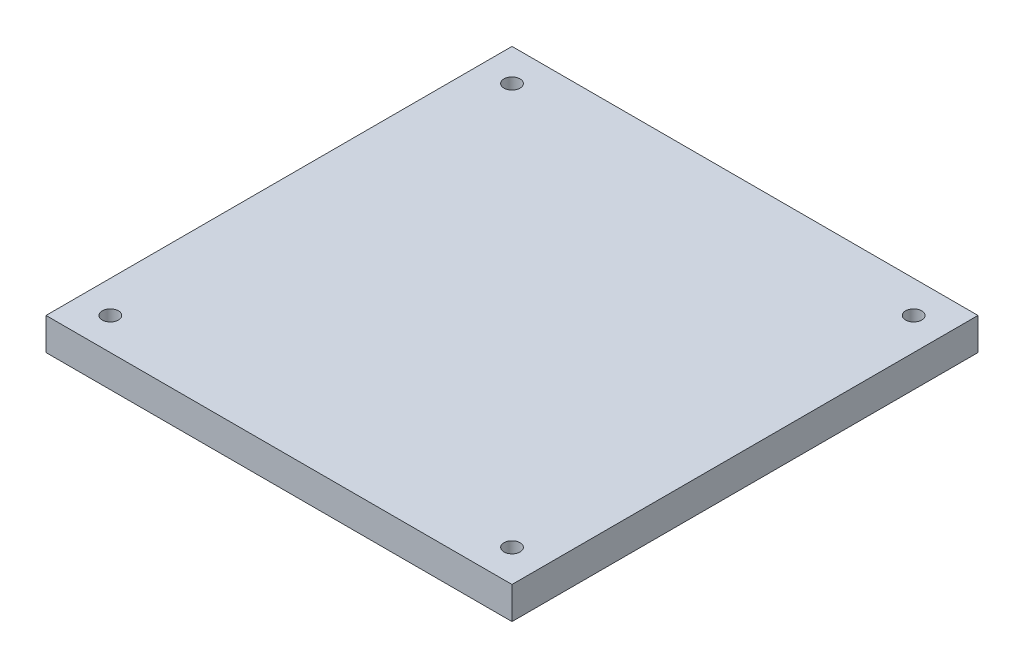
ISO-10303-21;
HEADER;
FILE_DESCRIPTION(('STEP AP214'),'2;1');
FILE_NAME('part.step','',(''),(''),'','','');
FILE_SCHEMA(('AUTOMOTIVE_DESIGN { 1 0 10303 214 1 1 1 1 }'));
ENDSEC;
DATA;
#1=APPLICATION_CONTEXT('core data for automotive mechanical design processes');
#2=APPLICATION_PROTOCOL_DEFINITION('international standard','automotive_design',2000,#1);
#3=PRODUCT_CONTEXT('',#1,'mechanical');
#4=PRODUCT('Part','Part','',(#3));
#5=PRODUCT_RELATED_PRODUCT_CATEGORY('part','',(#4));
#6=PRODUCT_DEFINITION_FORMATION('','',#4);
#7=PRODUCT_DEFINITION_CONTEXT('part definition',#1,'design');
#8=PRODUCT_DEFINITION('design','',#6,#7);
#9=PRODUCT_DEFINITION_SHAPE('','',#8);
#10=(LENGTH_UNIT() NAMED_UNIT(*) SI_UNIT(.MILLI.,.METRE.));
#11=(NAMED_UNIT(*) PLANE_ANGLE_UNIT() SI_UNIT($,.RADIAN.));
#12=(NAMED_UNIT(*) SI_UNIT($,.STERADIAN.) SOLID_ANGLE_UNIT());
#13=UNCERTAINTY_MEASURE_WITH_UNIT(LENGTH_MEASURE(1.E-05),#10,'distance_accuracy_value','');
#14=(GEOMETRIC_REPRESENTATION_CONTEXT(3) GLOBAL_UNCERTAINTY_ASSIGNED_CONTEXT((#13)) GLOBAL_UNIT_ASSIGNED_CONTEXT((#10,
#11,#12)) REPRESENTATION_CONTEXT('',''));
#15=CARTESIAN_POINT('',(0.,0.,0.));
#16=DIRECTION('',(0.,0.,1.));
#17=DIRECTION('',(1.,0.,0.));
#18=AXIS2_PLACEMENT_3D('',#15,#16,#17);
#19=CARTESIAN_POINT('',(0.,6.35,0.));
#20=DIRECTION('',(0.,1.,0.));
#21=DIRECTION('',(0.,0.,1.));
#22=AXIS2_PLACEMENT_3D('',#19,#20,#21);
#23=PLANE('',#22);
#24=CARTESIAN_POINT('',(-30.9701754385965,6.35,51.1342105263158));
#25=DIRECTION('',(0.,1.,0.));
#26=DIRECTION('',(0.,0.,1.));
#27=AXIS2_PLACEMENT_3D('',#24,#25,#26);
#28=CIRCLE('',#27,1.5875);
#29=CARTESIAN_POINT('',(-30.9701754385965,6.35,52.7217105263158));
#30=VERTEX_POINT('',#29);
#31=EDGE_CURVE('E121',#30,#30,#28,.T.);
#32=ORIENTED_EDGE('',*,*,#31,.F.);
#33=EDGE_LOOP('',(#32));
#34=FACE_BOUND('',#33,.T.);
#35=CARTESIAN_POINT('',(-30.9701754385965,6.35,-28.1411112499334));
#36=DIRECTION('',(0.,1.,0.));
#37=DIRECTION('',(0.,0.,1.));
#38=AXIS2_PLACEMENT_3D('',#35,#36,#37);
#39=CIRCLE('',#38,1.5875);
#40=CARTESIAN_POINT('',(-30.9701754385965,6.35,-26.5536112499334));
#41=VERTEX_POINT('',#40);
#42=EDGE_CURVE('E100',#41,#41,#39,.T.);
#43=ORIENTED_EDGE('',*,*,#42,.F.);
#44=EDGE_LOOP('',(#43));
#45=FACE_BOUND('',#44,.T.);
#46=DIRECTION('',(0.,0.,1.));
#47=VECTOR('',#46,1.);
#48=CARTESIAN_POINT('',(-37.3201754385965,6.35,-34.4911112499334));
#49=LINE('',#48,#47);
#50=CARTESIAN_POINT('',(-37.3201754385965,6.35,-34.4911112499334));
#51=VERTEX_POINT('',#50);
#52=CARTESIAN_POINT('',(-37.3201754385965,6.35,57.4842105263158));
#53=VERTEX_POINT('',#52);
#54=EDGE_CURVE('E85',#51,#53,#49,.T.);
#55=ORIENTED_EDGE('',*,*,#54,.T.);
#56=DIRECTION('',(1.,0.,0.));
#57=VECTOR('',#56,1.);
#58=CARTESIAN_POINT('',(-37.3201754385965,6.35,57.4842105263158));
#59=LINE('',#58,#57);
#60=CARTESIAN_POINT('',(54.6551463376527,6.35,57.4842105263158));
#61=VERTEX_POINT('',#60);
#62=EDGE_CURVE('E80',#53,#61,#59,.T.);
#63=ORIENTED_EDGE('',*,*,#62,.T.);
#64=DIRECTION('',(0.,0.,-1.));
#65=VECTOR('',#64,1.);
#66=CARTESIAN_POINT('',(54.6551463376527,6.35,-34.4911112499334));
#67=LINE('',#66,#65);
#68=CARTESIAN_POINT('',(54.6551463376527,6.35,-34.4911112499334));
#69=VERTEX_POINT('',#68);
#70=EDGE_CURVE('E83',#61,#69,#67,.T.);
#71=ORIENTED_EDGE('',*,*,#70,.T.);
#72=DIRECTION('',(-1.,0.,0.));
#73=VECTOR('',#72,1.);
#74=CARTESIAN_POINT('',(-37.3201754385965,6.35,-34.4911112499334));
#75=LINE('',#74,#73);
#76=EDGE_CURVE('E50',#69,#51,#75,.T.);
#77=ORIENTED_EDGE('',*,*,#76,.T.);
#78=EDGE_LOOP('',(#55,#63,#71,#77));
#79=FACE_BOUND('',#78,.T.);
#80=CARTESIAN_POINT('',(48.3051463376527,6.35,-28.1411112499334));
#81=DIRECTION('',(0.,1.,0.));
#82=DIRECTION('',(0.,0.,1.));
#83=AXIS2_PLACEMENT_3D('',#80,#81,#82);
#84=CIRCLE('',#83,1.5875);
#85=CARTESIAN_POINT('',(48.3051463376527,6.35,-26.5536112499334));
#86=VERTEX_POINT('',#85);
#87=EDGE_CURVE('E115',#86,#86,#84,.T.);
#88=ORIENTED_EDGE('',*,*,#87,.F.);
#89=EDGE_LOOP('',(#88));
#90=FACE_BOUND('',#89,.T.);
#91=CARTESIAN_POINT('',(48.3051463376527,6.35,51.1342105263158));
#92=DIRECTION('',(0.,1.,0.));
#93=DIRECTION('',(0.,0.,1.));
#94=AXIS2_PLACEMENT_3D('',#91,#92,#93);
#95=CIRCLE('',#94,1.5875);
#96=CARTESIAN_POINT('',(48.3051463376527,6.35,52.7217105263158));
#97=VERTEX_POINT('',#96);
#98=EDGE_CURVE('E127',#97,#97,#95,.T.);
#99=ORIENTED_EDGE('',*,*,#98,.F.);
#100=EDGE_LOOP('',(#99));
#101=FACE_BOUND('',#100,.T.);
#102=ADVANCED_FACE('F33',(#34,#45,#79,#90,#101),#23,.T.);
#103=CARTESIAN_POINT('',(0.,0.,0.));
#104=DIRECTION('',(0.,1.,0.));
#105=DIRECTION('',(0.,0.,1.));
#106=AXIS2_PLACEMENT_3D('',#103,#104,#105);
#107=PLANE('',#106);
#108=DIRECTION('',(0.,0.,1.));
#109=VECTOR('',#108,1.);
#110=CARTESIAN_POINT('',(-37.3201754385965,0.,-34.4911112499334));
#111=LINE('',#110,#109);
#112=CARTESIAN_POINT('',(-37.3201754385965,0.,-34.4911112499334));
#113=VERTEX_POINT('',#112);
#114=CARTESIAN_POINT('',(-37.3201754385965,0.,57.4842105263158));
#115=VERTEX_POINT('',#114);
#116=EDGE_CURVE('E97',#113,#115,#111,.T.);
#117=ORIENTED_EDGE('',*,*,#116,.F.);
#118=DIRECTION('',(-1.,0.,0.));
#119=VECTOR('',#118,1.);
#120=CARTESIAN_POINT('',(-37.3201754385965,0.,-34.4911112499334));
#121=LINE('',#120,#119);
#122=CARTESIAN_POINT('',(54.6551463376527,0.,-34.4911112499334));
#123=VERTEX_POINT('',#122);
#124=EDGE_CURVE('E73',#123,#113,#121,.T.);
#125=ORIENTED_EDGE('',*,*,#124,.F.);
#126=DIRECTION('',(0.,0.,-1.));
#127=VECTOR('',#126,1.);
#128=CARTESIAN_POINT('',(54.6551463376527,0.,-34.4911112499334));
#129=LINE('',#128,#127);
#130=CARTESIAN_POINT('',(54.6551463376527,0.,57.4842105263158));
#131=VERTEX_POINT('',#130);
#132=EDGE_CURVE('E67',#131,#123,#129,.T.);
#133=ORIENTED_EDGE('',*,*,#132,.F.);
#134=DIRECTION('',(1.,0.,0.));
#135=VECTOR('',#134,1.);
#136=CARTESIAN_POINT('',(-37.3201754385965,0.,57.4842105263158));
#137=LINE('',#136,#135);
#138=EDGE_CURVE('E89',#115,#131,#137,.T.);
#139=ORIENTED_EDGE('',*,*,#138,.F.);
#140=EDGE_LOOP('',(#117,#125,#133,#139));
#141=FACE_BOUND('',#140,.T.);
#142=CARTESIAN_POINT('',(-30.9701754385965,0.,-28.1411112499334));
#143=DIRECTION('',(0.,1.,0.));
#144=DIRECTION('',(0.,0.,1.));
#145=AXIS2_PLACEMENT_3D('',#142,#143,#144);
#146=CIRCLE('',#145,1.5875);
#147=CARTESIAN_POINT('',(-30.9701754385965,0.,-26.5536112499334));
#148=VERTEX_POINT('',#147);
#149=EDGE_CURVE('E112',#148,#148,#146,.T.);
#150=ORIENTED_EDGE('',*,*,#149,.T.);
#151=EDGE_LOOP('',(#150));
#152=FACE_BOUND('',#151,.T.);
#153=CARTESIAN_POINT('',(48.3051463376527,0.,-28.1411112499334));
#154=DIRECTION('',(0.,1.,0.));
#155=DIRECTION('',(0.,0.,1.));
#156=AXIS2_PLACEMENT_3D('',#153,#154,#155);
#157=CIRCLE('',#156,1.5875);
#158=CARTESIAN_POINT('',(48.3051463376527,0.,-26.5536112499334));
#159=VERTEX_POINT('',#158);
#160=EDGE_CURVE('E118',#159,#159,#157,.T.);
#161=ORIENTED_EDGE('',*,*,#160,.T.);
#162=EDGE_LOOP('',(#161));
#163=FACE_BOUND('',#162,.T.);
#164=CARTESIAN_POINT('',(-30.9701754385965,0.,51.1342105263158));
#165=DIRECTION('',(0.,1.,0.));
#166=DIRECTION('',(0.,0.,1.));
#167=AXIS2_PLACEMENT_3D('',#164,#165,#166);
#168=CIRCLE('',#167,1.5875);
#169=CARTESIAN_POINT('',(-30.9701754385965,0.,52.7217105263158));
#170=VERTEX_POINT('',#169);
#171=EDGE_CURVE('E124',#170,#170,#168,.T.);
#172=ORIENTED_EDGE('',*,*,#171,.T.);
#173=EDGE_LOOP('',(#172));
#174=FACE_BOUND('',#173,.T.);
#175=CARTESIAN_POINT('',(48.3051463376527,0.,51.1342105263158));
#176=DIRECTION('',(0.,1.,0.));
#177=DIRECTION('',(0.,0.,1.));
#178=AXIS2_PLACEMENT_3D('',#175,#176,#177);
#179=CIRCLE('',#178,1.5875);
#180=CARTESIAN_POINT('',(48.3051463376527,0.,52.7217105263158));
#181=VERTEX_POINT('',#180);
#182=EDGE_CURVE('E130',#181,#181,#179,.T.);
#183=ORIENTED_EDGE('',*,*,#182,.T.);
#184=EDGE_LOOP('',(#183));
#185=FACE_BOUND('',#184,.T.);
#186=ADVANCED_FACE('F108',(#141,#152,#163,#174,#185),#107,.F.);
#187=CARTESIAN_POINT('',(-37.3201754385965,6.35,-34.4911112499334));
#188=DIRECTION('',(1.,0.,0.));
#189=DIRECTION('',(0.,0.,-1.));
#190=AXIS2_PLACEMENT_3D('',#187,#188,#189);
#191=PLANE('',#190);
#192=ORIENTED_EDGE('',*,*,#116,.T.);
#193=DIRECTION('',(0.,-1.,0.));
#194=VECTOR('',#193,1.);
#195=CARTESIAN_POINT('',(-37.3201754385965,6.35,57.4842105263158));
#196=LINE('',#195,#194);
#197=EDGE_CURVE('E11',#53,#115,#196,.T.);
#198=ORIENTED_EDGE('',*,*,#197,.F.);
#199=ORIENTED_EDGE('',*,*,#54,.F.);
#200=DIRECTION('',(0.,-1.,0.));
#201=VECTOR('',#200,1.);
#202=CARTESIAN_POINT('',(-37.3201754385965,6.35,-34.4911112499334));
#203=LINE('',#202,#201);
#204=EDGE_CURVE('E93',#51,#113,#203,.T.);
#205=ORIENTED_EDGE('',*,*,#204,.T.);
#206=EDGE_LOOP('',(#192,#198,#199,#205));
#207=FACE_BOUND('',#206,.T.);
#208=ADVANCED_FACE('F35',(#207),#191,.F.);
#209=CARTESIAN_POINT('',(-37.3201754385965,6.35,57.4842105263158));
#210=DIRECTION('',(0.,0.,-1.));
#211=DIRECTION('',(-1.,0.,0.));
#212=AXIS2_PLACEMENT_3D('',#209,#210,#211);
#213=PLANE('',#212);
#214=ORIENTED_EDGE('',*,*,#138,.T.);
#215=DIRECTION('',(0.,-1.,0.));
#216=VECTOR('',#215,1.);
#217=CARTESIAN_POINT('',(54.6551463376527,6.35,57.4842105263158));
#218=LINE('',#217,#216);
#219=EDGE_CURVE('E42',#61,#131,#218,.T.);
#220=ORIENTED_EDGE('',*,*,#219,.F.);
#221=ORIENTED_EDGE('',*,*,#62,.F.);
#222=ORIENTED_EDGE('',*,*,#197,.T.);
#223=EDGE_LOOP('',(#214,#220,#221,#222));
#224=FACE_BOUND('',#223,.T.);
#225=ADVANCED_FACE('F88',(#224),#213,.F.);
#226=CARTESIAN_POINT('',(54.6551463376527,6.35,-34.4911112499334));
#227=DIRECTION('',(-1.,0.,0.));
#228=DIRECTION('',(0.,0.,1.));
#229=AXIS2_PLACEMENT_3D('',#226,#227,#228);
#230=PLANE('',#229);
#231=ORIENTED_EDGE('',*,*,#132,.T.);
#232=DIRECTION('',(0.,-1.,0.));
#233=VECTOR('',#232,1.);
#234=CARTESIAN_POINT('',(54.6551463376527,6.35,-34.4911112499334));
#235=LINE('',#234,#233);
#236=EDGE_CURVE('E90',#69,#123,#235,.T.);
#237=ORIENTED_EDGE('',*,*,#236,.F.);
#238=ORIENTED_EDGE('',*,*,#70,.F.);
#239=ORIENTED_EDGE('',*,*,#219,.T.);
#240=EDGE_LOOP('',(#231,#237,#238,#239));
#241=FACE_BOUND('',#240,.T.);
#242=ADVANCED_FACE('F91',(#241),#230,.F.);
#243=CARTESIAN_POINT('',(-37.3201754385965,6.35,-34.4911112499334));
#244=DIRECTION('',(0.,0.,1.));
#245=DIRECTION('',(1.,0.,0.));
#246=AXIS2_PLACEMENT_3D('',#243,#244,#245);
#247=PLANE('',#246);
#248=ORIENTED_EDGE('',*,*,#124,.T.);
#249=ORIENTED_EDGE('',*,*,#204,.F.);
#250=ORIENTED_EDGE('',*,*,#76,.F.);
#251=ORIENTED_EDGE('',*,*,#236,.T.);
#252=EDGE_LOOP('',(#248,#249,#250,#251));
#253=FACE_BOUND('',#252,.T.);
#254=ADVANCED_FACE('F105',(#253),#247,.F.);
#255=CARTESIAN_POINT('',(-30.9701754385965,6.35,-28.1411112499334));
#256=DIRECTION('',(0.,-1.,0.));
#257=DIRECTION('',(0.,0.,-1.));
#258=AXIS2_PLACEMENT_3D('',#255,#256,#257);
#259=CYLINDRICAL_SURFACE('',#258,1.5875);
#260=ORIENTED_EDGE('',*,*,#42,.T.);
#261=EDGE_LOOP('',(#260));
#262=FACE_BOUND('',#261,.T.);
#263=ORIENTED_EDGE('',*,*,#149,.F.);
#264=EDGE_LOOP('',(#263));
#265=FACE_BOUND('',#264,.T.);
#266=ADVANCED_FACE('F149',(#262,#265),#259,.F.);
#267=CARTESIAN_POINT('',(48.3051463376527,6.35,-28.1411112499334));
#268=DIRECTION('',(0.,-1.,0.));
#269=DIRECTION('',(0.,0.,-1.));
#270=AXIS2_PLACEMENT_3D('',#267,#268,#269);
#271=CYLINDRICAL_SURFACE('',#270,1.5875);
#272=ORIENTED_EDGE('',*,*,#87,.T.);
#273=EDGE_LOOP('',(#272));
#274=FACE_BOUND('',#273,.T.);
#275=ORIENTED_EDGE('',*,*,#160,.F.);
#276=EDGE_LOOP('',(#275));
#277=FACE_BOUND('',#276,.T.);
#278=ADVANCED_FACE('F195',(#274,#277),#271,.F.);
#279=CARTESIAN_POINT('',(-30.9701754385965,6.35,51.1342105263158));
#280=DIRECTION('',(0.,-1.,0.));
#281=DIRECTION('',(0.,0.,-1.));
#282=AXIS2_PLACEMENT_3D('',#279,#280,#281);
#283=CYLINDRICAL_SURFACE('',#282,1.5875);
#284=ORIENTED_EDGE('',*,*,#31,.T.);
#285=EDGE_LOOP('',(#284));
#286=FACE_BOUND('',#285,.T.);
#287=ORIENTED_EDGE('',*,*,#171,.F.);
#288=EDGE_LOOP('',(#287));
#289=FACE_BOUND('',#288,.T.);
#290=ADVANCED_FACE('F203',(#286,#289),#283,.F.);
#291=CARTESIAN_POINT('',(48.3051463376527,6.35,51.1342105263158));
#292=DIRECTION('',(0.,-1.,0.));
#293=DIRECTION('',(0.,0.,-1.));
#294=AXIS2_PLACEMENT_3D('',#291,#292,#293);
#295=CYLINDRICAL_SURFACE('',#294,1.5875);
#296=ORIENTED_EDGE('',*,*,#98,.T.);
#297=EDGE_LOOP('',(#296));
#298=FACE_BOUND('',#297,.T.);
#299=ORIENTED_EDGE('',*,*,#182,.F.);
#300=EDGE_LOOP('',(#299));
#301=FACE_BOUND('',#300,.T.);
#302=ADVANCED_FACE('F136',(#298,#301),#295,.F.);
#303=CLOSED_SHELL('',(#102,#186,#208,#225,#242,#254,#266,#278,#290,#302));
#304=MANIFOLD_SOLID_BREP('B2',#303);
#305=ADVANCED_BREP_SHAPE_REPRESENTATION('',(#18,#304),#14);
#306=SHAPE_DEFINITION_REPRESENTATION(#9,#305);
ENDSEC;
END-ISO-10303-21;
